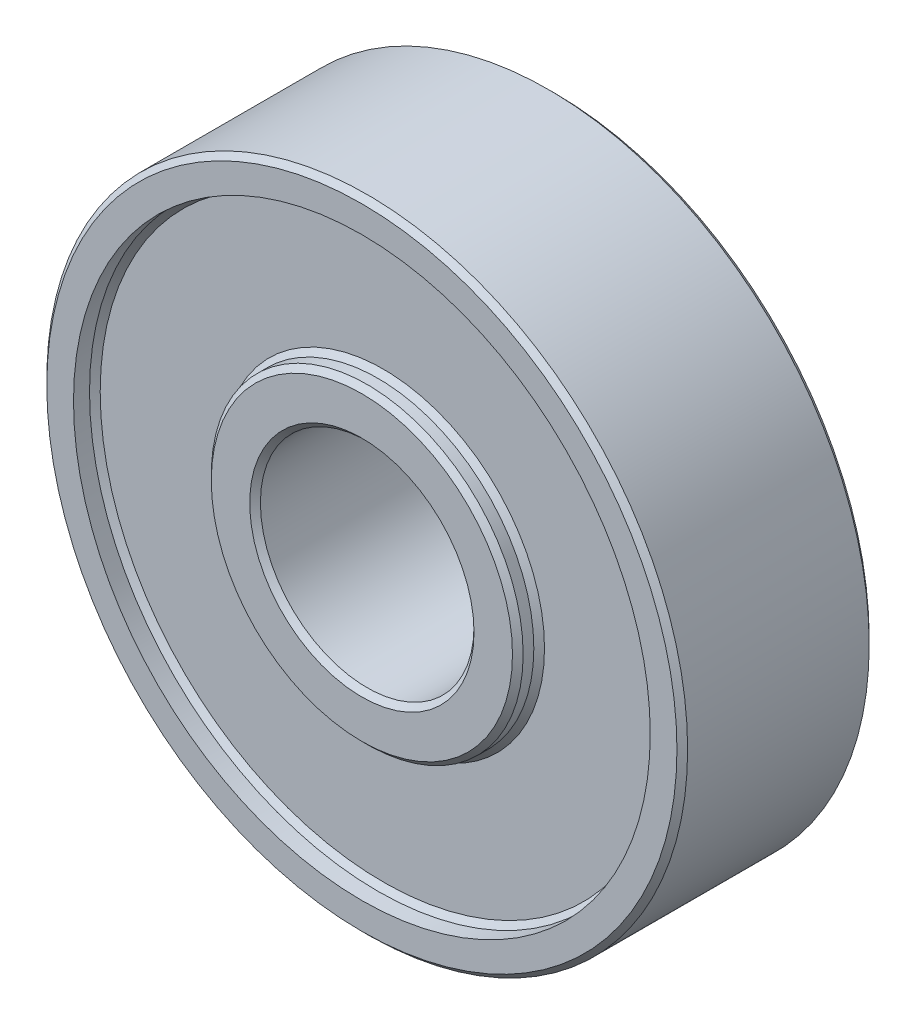
ISO-10303-21;
HEADER;
FILE_DESCRIPTION(('STEP AP214'),'2;1');
FILE_NAME('part.step','',(''),(''),'','','');
FILE_SCHEMA(('AUTOMOTIVE_DESIGN { 1 0 10303 214 1 1 1 1 }'));
ENDSEC;
DATA;
#1=APPLICATION_CONTEXT('core data for automotive mechanical design processes');
#2=APPLICATION_PROTOCOL_DEFINITION('international standard','automotive_design',2000,#1);
#3=PRODUCT_CONTEXT('',#1,'mechanical');
#4=PRODUCT('Part','Part','',(#3));
#5=PRODUCT_RELATED_PRODUCT_CATEGORY('part','',(#4));
#6=PRODUCT_DEFINITION_FORMATION('','',#4);
#7=PRODUCT_DEFINITION_CONTEXT('part definition',#1,'design');
#8=PRODUCT_DEFINITION('design','',#6,#7);
#9=PRODUCT_DEFINITION_SHAPE('','',#8);
#10=(LENGTH_UNIT() NAMED_UNIT(*) SI_UNIT(.MILLI.,.METRE.));
#11=(NAMED_UNIT(*) PLANE_ANGLE_UNIT() SI_UNIT($,.RADIAN.));
#12=(NAMED_UNIT(*) SI_UNIT($,.STERADIAN.) SOLID_ANGLE_UNIT());
#13=UNCERTAINTY_MEASURE_WITH_UNIT(LENGTH_MEASURE(1.E-05),#10,'distance_accuracy_value','');
#14=(GEOMETRIC_REPRESENTATION_CONTEXT(3) GLOBAL_UNCERTAINTY_ASSIGNED_CONTEXT((#13)) GLOBAL_UNIT_ASSIGNED_CONTEXT((#10,
#11,#12)) REPRESENTATION_CONTEXT('',''));
#15=CARTESIAN_POINT('',(0.,0.,0.));
#16=DIRECTION('',(0.,0.,1.));
#17=DIRECTION('',(1.,0.,0.));
#18=AXIS2_PLACEMENT_3D('',#15,#16,#17);
#19=CARTESIAN_POINT('',(0.,0.,0.));
#20=DIRECTION('',(0.,0.,1.));
#21=DIRECTION('',(1.,0.,0.));
#22=AXIS2_PLACEMENT_3D('',#19,#20,#21);
#23=PLANE('',#22);
#24=CARTESIAN_POINT('',(0.,0.,0.));
#25=DIRECTION('',(0.,0.,1.));
#26=DIRECTION('',(1.,0.,0.));
#27=AXIS2_PLACEMENT_3D('',#24,#25,#26);
#28=CIRCLE('',#27,7.05);
#29=CARTESIAN_POINT('',(7.05,0.,0.));
#30=VERTEX_POINT('',#29);
#31=EDGE_CURVE('E79',#30,#30,#28,.F.);
#32=ORIENTED_EDGE('',*,*,#31,.T.);
#33=EDGE_LOOP('',(#32));
#34=FACE_BOUND('',#33,.T.);
#35=CARTESIAN_POINT('',(0.,0.,0.));
#36=DIRECTION('',(0.,0.,1.));
#37=DIRECTION('',(1.,0.,0.));
#38=AXIS2_PLACEMENT_3D('',#35,#36,#37);
#39=CIRCLE('',#38,5.25);
#40=CARTESIAN_POINT('',(5.25,0.,0.));
#41=VERTEX_POINT('',#40);
#42=EDGE_CURVE('E82',#41,#41,#39,.T.);
#43=ORIENTED_EDGE('',*,*,#42,.T.);
#44=EDGE_LOOP('',(#43));
#45=FACE_BOUND('',#44,.T.);
#46=ADVANCED_FACE('F38',(#34,#45),#23,.F.);
#47=CARTESIAN_POINT('',(0.,0.,9.));
#48=DIRECTION('',(0.,0.,1.));
#49=DIRECTION('',(1.,0.,0.));
#50=AXIS2_PLACEMENT_3D('',#47,#48,#49);
#51=PLANE('',#50);
#52=CARTESIAN_POINT('',(0.,0.,9.));
#53=DIRECTION('',(0.,0.,1.));
#54=DIRECTION('',(1.,0.,0.));
#55=AXIS2_PLACEMENT_3D('',#52,#53,#54);
#56=CIRCLE('',#55,5.25);
#57=CARTESIAN_POINT('',(5.25,0.,9.));
#58=VERTEX_POINT('',#57);
#59=EDGE_CURVE('E67',#58,#58,#56,.F.);
#60=ORIENTED_EDGE('',*,*,#59,.T.);
#61=EDGE_LOOP('',(#60));
#62=FACE_BOUND('',#61,.T.);
#63=CARTESIAN_POINT('',(0.,0.,9.));
#64=DIRECTION('',(0.,0.,1.));
#65=DIRECTION('',(1.,0.,0.));
#66=AXIS2_PLACEMENT_3D('',#63,#64,#65);
#67=CIRCLE('',#66,7.04999999999999);
#68=CARTESIAN_POINT('',(7.04999999999999,0.,9.));
#69=VERTEX_POINT('',#68);
#70=EDGE_CURVE('E70',#69,#69,#67,.T.);
#71=ORIENTED_EDGE('',*,*,#70,.T.);
#72=EDGE_LOOP('',(#71));
#73=FACE_BOUND('',#72,.T.);
#74=ADVANCED_FACE('F132',(#62,#73),#51,.T.);
#75=CARTESIAN_POINT('',(0.,0.,9.));
#76=DIRECTION('',(0.,0.,-1.));
#77=DIRECTION('',(-1.,0.,0.));
#78=AXIS2_PLACEMENT_3D('',#75,#76,#77);
#79=CYLINDRICAL_SURFACE('',#78,15.);
#80=CARTESIAN_POINT('',(0.,0.,0.250000000000002));
#81=DIRECTION('',(0.,0.,1.));
#82=DIRECTION('',(1.,0.,0.));
#83=AXIS2_PLACEMENT_3D('',#80,#81,#82);
#84=CIRCLE('',#83,15.);
#85=CARTESIAN_POINT('',(15.,0.,0.250000000000002));
#86=VERTEX_POINT('',#85);
#87=EDGE_CURVE('E49',#86,#86,#84,.T.);
#88=ORIENTED_EDGE('',*,*,#87,.T.);
#89=EDGE_LOOP('',(#88));
#90=FACE_BOUND('',#89,.T.);
#91=CARTESIAN_POINT('',(0.,0.,8.74999999999999));
#92=DIRECTION('',(0.,0.,1.));
#93=DIRECTION('',(1.,0.,0.));
#94=AXIS2_PLACEMENT_3D('',#91,#92,#93);
#95=CIRCLE('',#94,15.);
#96=CARTESIAN_POINT('',(15.,0.,8.74999999999999));
#97=VERTEX_POINT('',#96);
#98=EDGE_CURVE('E53',#97,#97,#95,.F.);
#99=ORIENTED_EDGE('',*,*,#98,.T.);
#100=EDGE_LOOP('',(#99));
#101=FACE_BOUND('',#100,.T.);
#102=ADVANCED_FACE('F138',(#90,#101),#79,.T.);
#103=CARTESIAN_POINT('',(0.,0.,9.));
#104=DIRECTION('',(0.,0.,1.));
#105=DIRECTION('',(1.,0.,0.));
#106=AXIS2_PLACEMENT_3D('',#103,#104,#105);
#107=CIRCLE('',#106,14.75);
#108=CARTESIAN_POINT('',(14.75,0.,9.));
#109=VERTEX_POINT('',#108);
#110=EDGE_CURVE('E10',#109,#109,#107,.T.);
#111=ORIENTED_EDGE('',*,*,#110,.T.);
#112=EDGE_LOOP('',(#111));
#113=FACE_BOUND('',#112,.T.);
#114=CARTESIAN_POINT('',(0.,0.,9.));
#115=DIRECTION('',(0.,0.,1.));
#116=DIRECTION('',(1.,0.,0.));
#117=AXIS2_PLACEMENT_3D('',#114,#115,#116);
#118=CIRCLE('',#117,13.5);
#119=CARTESIAN_POINT('',(13.5,0.,9.));
#120=VERTEX_POINT('',#119);
#121=EDGE_CURVE('E106',#120,#120,#118,.T.);
#122=ORIENTED_EDGE('',*,*,#121,.F.);
#123=EDGE_LOOP('',(#122));
#124=FACE_BOUND('',#123,.T.);
#125=ADVANCED_FACE('F141',(#113,#124),#51,.T.);
#126=CARTESIAN_POINT('',(0.,0.,0.));
#127=DIRECTION('',(0.,0.,1.));
#128=DIRECTION('',(1.,0.,0.));
#129=AXIS2_PLACEMENT_3D('',#126,#127,#128);
#130=CIRCLE('',#129,14.75);
#131=CARTESIAN_POINT('',(14.75,0.,0.));
#132=VERTEX_POINT('',#131);
#133=EDGE_CURVE('E45',#132,#132,#130,.F.);
#134=ORIENTED_EDGE('',*,*,#133,.T.);
#135=EDGE_LOOP('',(#134));
#136=FACE_BOUND('',#135,.T.);
#137=CARTESIAN_POINT('',(0.,0.,0.));
#138=DIRECTION('',(0.,0.,1.));
#139=DIRECTION('',(1.,0.,0.));
#140=AXIS2_PLACEMENT_3D('',#137,#138,#139);
#141=CIRCLE('',#140,13.5);
#142=CARTESIAN_POINT('',(13.5,0.,0.));
#143=VERTEX_POINT('',#142);
#144=EDGE_CURVE('E109',#143,#143,#141,.T.);
#145=ORIENTED_EDGE('',*,*,#144,.T.);
#146=EDGE_LOOP('',(#145));
#147=FACE_BOUND('',#146,.T.);
#148=ADVANCED_FACE('F113',(#136,#147),#23,.F.);
#149=CARTESIAN_POINT('',(0.,0.,9.));
#150=DIRECTION('',(0.,0.,-1.));
#151=DIRECTION('',(-1.,0.,0.));
#152=AXIS2_PLACEMENT_3D('',#149,#150,#151);
#153=CYLINDRICAL_SURFACE('',#152,5.);
#154=CARTESIAN_POINT('',(0.,0.,0.250000000000009));
#155=DIRECTION('',(0.,0.,1.));
#156=DIRECTION('',(1.,0.,0.));
#157=AXIS2_PLACEMENT_3D('',#154,#155,#156);
#158=CIRCLE('',#157,5.);
#159=CARTESIAN_POINT('',(5.,0.,0.250000000000009));
#160=VERTEX_POINT('',#159);
#161=EDGE_CURVE('E73',#160,#160,#158,.F.);
#162=ORIENTED_EDGE('',*,*,#161,.T.);
#163=EDGE_LOOP('',(#162));
#164=FACE_BOUND('',#163,.T.);
#165=CARTESIAN_POINT('',(0.,0.,8.75));
#166=DIRECTION('',(0.,0.,1.));
#167=DIRECTION('',(1.,0.,0.));
#168=AXIS2_PLACEMENT_3D('',#165,#166,#167);
#169=CIRCLE('',#168,5.);
#170=CARTESIAN_POINT('',(5.,0.,8.75));
#171=VERTEX_POINT('',#170);
#172=EDGE_CURVE('E76',#171,#171,#169,.T.);
#173=ORIENTED_EDGE('',*,*,#172,.T.);
#174=EDGE_LOOP('',(#173));
#175=FACE_BOUND('',#174,.T.);
#176=ADVANCED_FACE('F145',(#164,#175),#153,.F.);
#177=CARTESIAN_POINT('',(0.,0.,9.));
#178=DIRECTION('',(0.,0.,1.));
#179=DIRECTION('',(1.,0.,0.));
#180=AXIS2_PLACEMENT_3D('',#177,#178,#179);
#181=CYLINDRICAL_SURFACE('',#180,7.3);
#182=CARTESIAN_POINT('',(0.,0.,8.25000000000001));
#183=DIRECTION('',(0.,0.,-1.));
#184=DIRECTION('',(-1.,0.,0.));
#185=AXIS2_PLACEMENT_3D('',#182,#183,#184);
#186=CIRCLE('',#185,7.3);
#187=CARTESIAN_POINT('',(-7.3,0.,8.25000000000001));
#188=VERTEX_POINT('',#187);
#189=EDGE_CURVE('E91',#188,#188,#186,.F.);
#190=ORIENTED_EDGE('',*,*,#189,.T.);
#191=EDGE_LOOP('',(#190));
#192=FACE_BOUND('',#191,.T.);
#193=CARTESIAN_POINT('',(0.,0.,8.74999999999999));
#194=DIRECTION('',(0.,0.,1.));
#195=DIRECTION('',(1.,0.,0.));
#196=AXIS2_PLACEMENT_3D('',#193,#194,#195);
#197=CIRCLE('',#196,7.3);
#198=CARTESIAN_POINT('',(7.3,0.,8.74999999999999));
#199=VERTEX_POINT('',#198);
#200=EDGE_CURVE('E94',#199,#199,#197,.F.);
#201=ORIENTED_EDGE('',*,*,#200,.T.);
#202=EDGE_LOOP('',(#201));
#203=FACE_BOUND('',#202,.T.);
#204=ADVANCED_FACE('F150',(#192,#203),#181,.T.);
#205=CARTESIAN_POINT('',(7.3,0.,8.));
#206=DIRECTION('',(0.,0.,-1.));
#207=DIRECTION('',(-1.,0.,0.));
#208=AXIS2_PLACEMENT_3D('',#205,#206,#207);
#209=PLANE('',#208);
#210=CARTESIAN_POINT('',(0.,0.,8.));
#211=DIRECTION('',(0.,0.,-1.));
#212=DIRECTION('',(-1.,0.,0.));
#213=AXIS2_PLACEMENT_3D('',#210,#211,#212);
#214=CIRCLE('',#213,13.25);
#215=CARTESIAN_POINT('',(-13.25,0.,8.));
#216=VERTEX_POINT('',#215);
#217=EDGE_CURVE('E100',#216,#216,#214,.F.);
#218=ORIENTED_EDGE('',*,*,#217,.T.);
#219=EDGE_LOOP('',(#218));
#220=FACE_BOUND('',#219,.T.);
#221=CARTESIAN_POINT('',(0.,0.,8.));
#222=DIRECTION('',(0.,0.,-1.));
#223=DIRECTION('',(-1.,0.,0.));
#224=AXIS2_PLACEMENT_3D('',#221,#222,#223);
#225=CIRCLE('',#224,7.55);
#226=CARTESIAN_POINT('',(-7.55,0.,8.));
#227=VERTEX_POINT('',#226);
#228=EDGE_CURVE('E103',#227,#227,#225,.T.);
#229=ORIENTED_EDGE('',*,*,#228,.T.);
#230=EDGE_LOOP('',(#229));
#231=FACE_BOUND('',#230,.T.);
#232=ADVANCED_FACE('F161',(#220,#231),#209,.F.);
#233=CARTESIAN_POINT('',(0.,0.,9.));
#234=DIRECTION('',(0.,0.,1.));
#235=DIRECTION('',(1.,0.,0.));
#236=AXIS2_PLACEMENT_3D('',#233,#234,#235);
#237=CYLINDRICAL_SURFACE('',#236,13.5);
#238=CARTESIAN_POINT('',(0.,0.,8.24999999999998));
#239=DIRECTION('',(0.,0.,-1.));
#240=DIRECTION('',(-1.,0.,0.));
#241=AXIS2_PLACEMENT_3D('',#238,#239,#240);
#242=CIRCLE('',#241,13.5);
#243=CARTESIAN_POINT('',(-13.5,0.,8.24999999999998));
#244=VERTEX_POINT('',#243);
#245=EDGE_CURVE('E97',#244,#244,#242,.T.);
#246=ORIENTED_EDGE('',*,*,#245,.T.);
#247=EDGE_LOOP('',(#246));
#248=FACE_BOUND('',#247,.T.);
#249=ORIENTED_EDGE('',*,*,#121,.T.);
#250=EDGE_LOOP('',(#249));
#251=FACE_BOUND('',#250,.T.);
#252=ADVANCED_FACE('F165',(#248,#251),#237,.F.);
#253=CARTESIAN_POINT('',(0.,0.,9.));
#254=DIRECTION('',(0.,0.,1.));
#255=DIRECTION('',(1.,0.,0.));
#256=AXIS2_PLACEMENT_3D('',#253,#254,#255);
#257=CYLINDRICAL_SURFACE('',#256,7.3);
#258=CARTESIAN_POINT('',(0.,0.,0.249999999999999));
#259=DIRECTION('',(0.,0.,1.));
#260=DIRECTION('',(1.,0.,0.));
#261=AXIS2_PLACEMENT_3D('',#258,#259,#260);
#262=CIRCLE('',#261,7.3);
#263=CARTESIAN_POINT('',(7.3,0.,0.249999999999999));
#264=VERTEX_POINT('',#263);
#265=EDGE_CURVE('E85',#264,#264,#262,.T.);
#266=ORIENTED_EDGE('',*,*,#265,.T.);
#267=EDGE_LOOP('',(#266));
#268=FACE_BOUND('',#267,.T.);
#269=CARTESIAN_POINT('',(0.,0.,0.750000000000009));
#270=DIRECTION('',(0.,0.,1.));
#271=DIRECTION('',(1.,0.,0.));
#272=AXIS2_PLACEMENT_3D('',#269,#270,#271);
#273=CIRCLE('',#272,7.3);
#274=CARTESIAN_POINT('',(7.3,0.,0.750000000000009));
#275=VERTEX_POINT('',#274);
#276=EDGE_CURVE('E88',#275,#275,#273,.F.);
#277=ORIENTED_EDGE('',*,*,#276,.T.);
#278=EDGE_LOOP('',(#277));
#279=FACE_BOUND('',#278,.T.);
#280=ADVANCED_FACE('F128',(#268,#279),#257,.T.);
#281=CARTESIAN_POINT('',(7.3,0.,1.));
#282=DIRECTION('',(0.,0.,1.));
#283=DIRECTION('',(1.,0.,0.));
#284=AXIS2_PLACEMENT_3D('',#281,#282,#283);
#285=PLANE('',#284);
#286=CARTESIAN_POINT('',(0.,0.,1.));
#287=DIRECTION('',(0.,0.,1.));
#288=DIRECTION('',(1.,0.,0.));
#289=AXIS2_PLACEMENT_3D('',#286,#287,#288);
#290=CIRCLE('',#289,7.55);
#291=CARTESIAN_POINT('',(7.55,0.,1.));
#292=VERTEX_POINT('',#291);
#293=EDGE_CURVE('E61',#292,#292,#290,.T.);
#294=ORIENTED_EDGE('',*,*,#293,.T.);
#295=EDGE_LOOP('',(#294));
#296=FACE_BOUND('',#295,.T.);
#297=CARTESIAN_POINT('',(0.,0.,1.));
#298=DIRECTION('',(0.,0.,1.));
#299=DIRECTION('',(1.,0.,0.));
#300=AXIS2_PLACEMENT_3D('',#297,#298,#299);
#301=CIRCLE('',#300,13.25);
#302=CARTESIAN_POINT('',(13.25,0.,1.));
#303=VERTEX_POINT('',#302);
#304=EDGE_CURVE('E64',#303,#303,#301,.F.);
#305=ORIENTED_EDGE('',*,*,#304,.T.);
#306=EDGE_LOOP('',(#305));
#307=FACE_BOUND('',#306,.T.);
#308=ADVANCED_FACE('F118',(#296,#307),#285,.F.);
#309=CARTESIAN_POINT('',(0.,0.,9.));
#310=DIRECTION('',(0.,0.,1.));
#311=DIRECTION('',(1.,0.,0.));
#312=AXIS2_PLACEMENT_3D('',#309,#310,#311);
#313=CYLINDRICAL_SURFACE('',#312,13.5);
#314=CARTESIAN_POINT('',(0.,0.,0.749999999999995));
#315=DIRECTION('',(0.,0.,1.));
#316=DIRECTION('',(1.,0.,0.));
#317=AXIS2_PLACEMENT_3D('',#314,#315,#316);
#318=CIRCLE('',#317,13.5);
#319=CARTESIAN_POINT('',(13.5,0.,0.749999999999995));
#320=VERTEX_POINT('',#319);
#321=EDGE_CURVE('E58',#320,#320,#318,.T.);
#322=ORIENTED_EDGE('',*,*,#321,.T.);
#323=EDGE_LOOP('',(#322));
#324=FACE_BOUND('',#323,.T.);
#325=ORIENTED_EDGE('',*,*,#144,.F.);
#326=EDGE_LOOP('',(#325));
#327=FACE_BOUND('',#326,.T.);
#328=ADVANCED_FACE('F115',(#324,#327),#313,.F.);
#329=CARTESIAN_POINT('',(0.,0.,8.));
#330=DIRECTION('',(0.,0.,1.));
#331=DIRECTION('',(1.,0.,0.));
#332=AXIS2_PLACEMENT_3D('',#329,#330,#331);
#333=CONICAL_SURFACE('',#332,13.25,0.785398163397459);
#334=ORIENTED_EDGE('',*,*,#245,.F.);
#335=EDGE_LOOP('',(#334));
#336=FACE_BOUND('',#335,.T.);
#337=ORIENTED_EDGE('',*,*,#217,.F.);
#338=EDGE_LOOP('',(#337));
#339=FACE_BOUND('',#338,.T.);
#340=ADVANCED_FACE('F117',(#336,#339),#333,.F.);
#341=CARTESIAN_POINT('',(0.,0.,8.25000000000001));
#342=DIRECTION('',(0.,0.,-1.));
#343=DIRECTION('',(-1.,0.,0.));
#344=AXIS2_PLACEMENT_3D('',#341,#342,#343);
#345=CONICAL_SURFACE('',#344,7.3,0.785398163397426);
#346=ORIENTED_EDGE('',*,*,#228,.F.);
#347=EDGE_LOOP('',(#346));
#348=FACE_BOUND('',#347,.T.);
#349=ORIENTED_EDGE('',*,*,#189,.F.);
#350=EDGE_LOOP('',(#349));
#351=FACE_BOUND('',#350,.T.);
#352=ADVANCED_FACE('F125',(#348,#351),#345,.T.);
#353=CARTESIAN_POINT('',(0.,0.,0.249999999999999));
#354=DIRECTION('',(0.,0.,1.));
#355=DIRECTION('',(1.,0.,0.));
#356=AXIS2_PLACEMENT_3D('',#353,#354,#355);
#357=CONICAL_SURFACE('',#356,7.3,0.785398163397443);
#358=ORIENTED_EDGE('',*,*,#31,.F.);
#359=EDGE_LOOP('',(#358));
#360=FACE_BOUND('',#359,.T.);
#361=ORIENTED_EDGE('',*,*,#265,.F.);
#362=EDGE_LOOP('',(#361));
#363=FACE_BOUND('',#362,.T.);
#364=ADVANCED_FACE('F275',(#360,#363),#357,.T.);
#365=CARTESIAN_POINT('',(0.,0.,0.250000000000009));
#366=DIRECTION('',(0.,0.,-1.));
#367=DIRECTION('',(-1.,0.,0.));
#368=AXIS2_PLACEMENT_3D('',#365,#366,#367);
#369=CONICAL_SURFACE('',#368,5.,0.785398163397433);
#370=ORIENTED_EDGE('',*,*,#42,.F.);
#371=EDGE_LOOP('',(#370));
#372=FACE_BOUND('',#371,.T.);
#373=ORIENTED_EDGE('',*,*,#161,.F.);
#374=EDGE_LOOP('',(#373));
#375=FACE_BOUND('',#374,.T.);
#376=ADVANCED_FACE('F226',(#372,#375),#369,.F.);
#377=CARTESIAN_POINT('',(0.,0.,9.));
#378=DIRECTION('',(0.,0.,1.));
#379=DIRECTION('',(1.,0.,0.));
#380=AXIS2_PLACEMENT_3D('',#377,#378,#379);
#381=CONICAL_SURFACE('',#380,5.25,0.785398163397443);
#382=ORIENTED_EDGE('',*,*,#172,.F.);
#383=EDGE_LOOP('',(#382));
#384=FACE_BOUND('',#383,.T.);
#385=ORIENTED_EDGE('',*,*,#59,.F.);
#386=EDGE_LOOP('',(#385));
#387=FACE_BOUND('',#386,.T.);
#388=ADVANCED_FACE('F182',(#384,#387),#381,.F.);
#389=CARTESIAN_POINT('',(0.,0.,1.));
#390=DIRECTION('',(0.,0.,1.));
#391=DIRECTION('',(1.,0.,0.));
#392=AXIS2_PLACEMENT_3D('',#389,#390,#391);
#393=CONICAL_SURFACE('',#392,7.55,0.785398163397457);
#394=ORIENTED_EDGE('',*,*,#276,.F.);
#395=EDGE_LOOP('',(#394));
#396=FACE_BOUND('',#395,.T.);
#397=ORIENTED_EDGE('',*,*,#293,.F.);
#398=EDGE_LOOP('',(#397));
#399=FACE_BOUND('',#398,.T.);
#400=ADVANCED_FACE('F178',(#396,#399),#393,.T.);
#401=CARTESIAN_POINT('',(0.,0.,0.749999999999995));
#402=DIRECTION('',(0.,0.,-1.));
#403=DIRECTION('',(-1.,0.,0.));
#404=AXIS2_PLACEMENT_3D('',#401,#402,#403);
#405=CONICAL_SURFACE('',#404,13.5,0.785398163397448);
#406=ORIENTED_EDGE('',*,*,#304,.F.);
#407=EDGE_LOOP('',(#406));
#408=FACE_BOUND('',#407,.T.);
#409=ORIENTED_EDGE('',*,*,#321,.F.);
#410=EDGE_LOOP('',(#409));
#411=FACE_BOUND('',#410,.T.);
#412=ADVANCED_FACE('F181',(#408,#411),#405,.F.);
#413=CARTESIAN_POINT('',(0.,0.,0.250000000000002));
#414=DIRECTION('',(0.,0.,1.));
#415=DIRECTION('',(1.,0.,0.));
#416=AXIS2_PLACEMENT_3D('',#413,#414,#415);
#417=CONICAL_SURFACE('',#416,15.,0.785398163397448);
#418=ORIENTED_EDGE('',*,*,#133,.F.);
#419=EDGE_LOOP('',(#418));
#420=FACE_BOUND('',#419,.T.);
#421=ORIENTED_EDGE('',*,*,#87,.F.);
#422=EDGE_LOOP('',(#421));
#423=FACE_BOUND('',#422,.T.);
#424=ADVANCED_FACE('F190',(#420,#423),#417,.T.);
#425=CARTESIAN_POINT('',(0.,0.,9.));
#426=DIRECTION('',(0.,0.,-1.));
#427=DIRECTION('',(-1.,0.,0.));
#428=AXIS2_PLACEMENT_3D('',#425,#426,#427);
#429=CONICAL_SURFACE('',#428,14.75,0.785398163397435);
#430=ORIENTED_EDGE('',*,*,#98,.F.);
#431=EDGE_LOOP('',(#430));
#432=FACE_BOUND('',#431,.T.);
#433=ORIENTED_EDGE('',*,*,#110,.F.);
#434=EDGE_LOOP('',(#433));
#435=FACE_BOUND('',#434,.T.);
#436=ADVANCED_FACE('F196',(#432,#435),#429,.T.);
#437=CARTESIAN_POINT('',(0.,0.,9.));
#438=DIRECTION('',(0.,0.,-1.));
#439=DIRECTION('',(-1.,0.,0.));
#440=AXIS2_PLACEMENT_3D('',#437,#438,#439);
#441=CONICAL_SURFACE('',#440,7.04999999999999,0.78539816339745);
#442=ORIENTED_EDGE('',*,*,#200,.F.);
#443=EDGE_LOOP('',(#442));
#444=FACE_BOUND('',#443,.T.);
#445=ORIENTED_EDGE('',*,*,#70,.F.);
#446=EDGE_LOOP('',(#445));
#447=FACE_BOUND('',#446,.T.);
#448=ADVANCED_FACE('F40',(#444,#447),#441,.T.);
#449=CLOSED_SHELL('',(#46,#74,#102,#125,#148,#176,#204,#232,#252,#280,#308,#328,#340,#352,#364,
#376,#388,#400,#412,#424,#436,#448));
#450=MANIFOLD_SOLID_BREP('B2',#449);
#451=ADVANCED_BREP_SHAPE_REPRESENTATION('',(#18,#450),#14);
#452=SHAPE_DEFINITION_REPRESENTATION(#9,#451);
ENDSEC;
END-ISO-10303-21;
